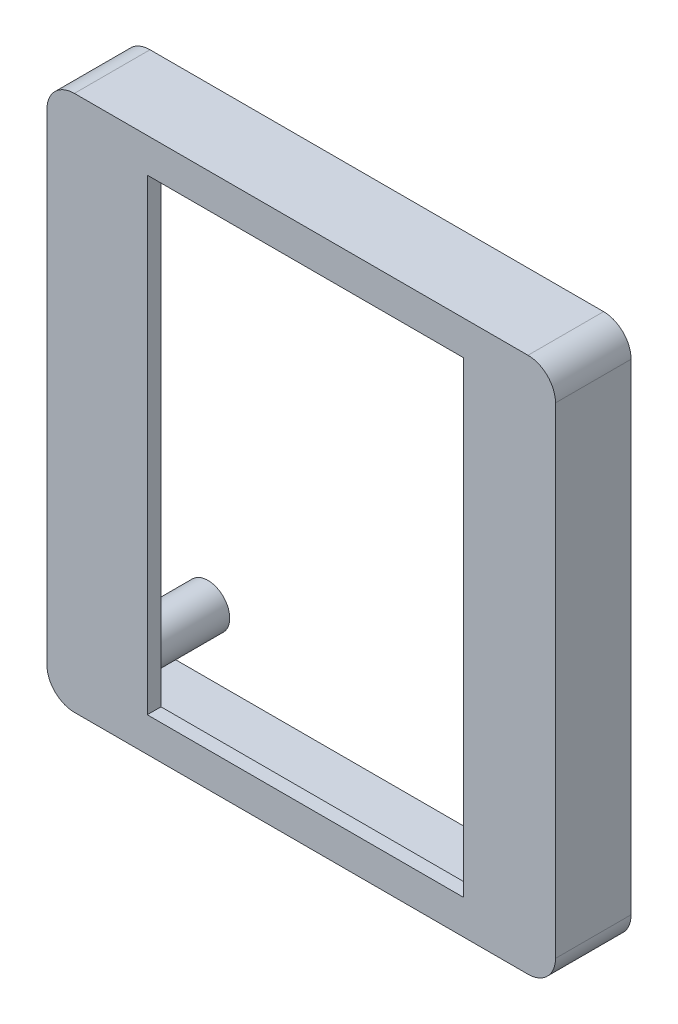
ISO-10303-21;
HEADER;
FILE_DESCRIPTION(('STEP AP214'),'2;1');
FILE_NAME('part.step','',(''),(''),'','','');
FILE_SCHEMA(('AUTOMOTIVE_DESIGN { 1 0 10303 214 1 1 1 1 }'));
ENDSEC;
DATA;
#1=APPLICATION_CONTEXT('core data for automotive mechanical design processes');
#2=APPLICATION_PROTOCOL_DEFINITION('international standard','automotive_design',2000,#1);
#3=PRODUCT_CONTEXT('',#1,'mechanical');
#4=PRODUCT('Part','Part','',(#3));
#5=PRODUCT_RELATED_PRODUCT_CATEGORY('part','',(#4));
#6=PRODUCT_DEFINITION_FORMATION('','',#4);
#7=PRODUCT_DEFINITION_CONTEXT('part definition',#1,'design');
#8=PRODUCT_DEFINITION('design','',#6,#7);
#9=PRODUCT_DEFINITION_SHAPE('','',#8);
#10=(LENGTH_UNIT() NAMED_UNIT(*) SI_UNIT(.MILLI.,.METRE.));
#11=(NAMED_UNIT(*) PLANE_ANGLE_UNIT() SI_UNIT($,.RADIAN.));
#12=(NAMED_UNIT(*) SI_UNIT($,.STERADIAN.) SOLID_ANGLE_UNIT());
#13=UNCERTAINTY_MEASURE_WITH_UNIT(LENGTH_MEASURE(1.E-05),#10,'distance_accuracy_value','');
#14=(GEOMETRIC_REPRESENTATION_CONTEXT(3) GLOBAL_UNCERTAINTY_ASSIGNED_CONTEXT((#13)) GLOBAL_UNIT_ASSIGNED_CONTEXT((#10,
#11,#12)) REPRESENTATION_CONTEXT('',''));
#15=CARTESIAN_POINT('',(0.,0.,0.));
#16=DIRECTION('',(0.,0.,1.));
#17=DIRECTION('',(1.,0.,0.));
#18=AXIS2_PLACEMENT_3D('',#15,#16,#17);
#19=CARTESIAN_POINT('',(0.,0.,6.5));
#20=DIRECTION('',(0.,0.,1.));
#21=DIRECTION('',(1.,0.,0.));
#22=AXIS2_PLACEMENT_3D('',#19,#20,#21);
#23=PLANE('',#22);
#24=DIRECTION('',(1.,0.,0.));
#25=VECTOR('',#24,1.);
#26=CARTESIAN_POINT('',(0.,2.84999999999995,6.5));
#27=LINE('',#26,#25);
#28=CARTESIAN_POINT('',(-10.6969645109202,2.84999999999995,6.5));
#29=VERTEX_POINT('',#28);
#30=CARTESIAN_POINT('',(12.3030354890798,2.84999999999995,6.5));
#31=VERTEX_POINT('',#30);
#32=EDGE_CURVE('E154',#29,#31,#27,.T.);
#33=ORIENTED_EDGE('',*,*,#32,.F.);
#34=DIRECTION('',(0.,-1.,0.));
#35=VECTOR('',#34,1.);
#36=CARTESIAN_POINT('',(-10.6969645109202,0.,6.5));
#37=LINE('',#36,#35);
#38=CARTESIAN_POINT('',(-10.6969645109202,-31.1500000000001,6.5));
#39=VERTEX_POINT('',#38);
#40=EDGE_CURVE('E163',#29,#39,#37,.T.);
#41=ORIENTED_EDGE('',*,*,#40,.T.);
#42=DIRECTION('',(1.,0.,0.));
#43=VECTOR('',#42,1.);
#44=CARTESIAN_POINT('',(0.,-31.1500000000001,6.5));
#45=LINE('',#44,#43);
#46=CARTESIAN_POINT('',(12.3030354890798,-31.1500000000001,6.5));
#47=VERTEX_POINT('',#46);
#48=EDGE_CURVE('E160',#39,#47,#45,.T.);
#49=ORIENTED_EDGE('',*,*,#48,.T.);
#50=DIRECTION('',(0.,-1.,0.));
#51=VECTOR('',#50,1.);
#52=CARTESIAN_POINT('',(12.3030354890798,0.,6.5));
#53=LINE('',#52,#51);
#54=EDGE_CURVE('E156',#31,#47,#53,.T.);
#55=ORIENTED_EDGE('',*,*,#54,.F.);
#56=EDGE_LOOP('',(#33,#41,#49,#55));
#57=FACE_BOUND('',#56,.T.);
#58=CARTESIAN_POINT('',(14.7905354890798,1.26249999999992,6.5));
#59=DIRECTION('',(0.,0.,1.));
#60=DIRECTION('',(1.,0.,0.));
#61=AXIS2_PLACEMENT_3D('',#58,#59,#60);
#62=CIRCLE('',#61,1.5875);
#63=CARTESIAN_POINT('',(16.3780354890798,1.26249999999992,6.5));
#64=VERTEX_POINT('',#63);
#65=EDGE_CURVE('E194',#64,#64,#62,.T.);
#66=ORIENTED_EDGE('',*,*,#65,.T.);
#67=EDGE_LOOP('',(#66));
#68=FACE_BOUND('',#67,.T.);
#69=CARTESIAN_POINT('',(14.7905354890798,-29.5625,6.5));
#70=DIRECTION('',(0.,0.,1.));
#71=DIRECTION('',(1.,0.,0.));
#72=AXIS2_PLACEMENT_3D('',#69,#70,#71);
#73=CIRCLE('',#72,1.58750000000005);
#74=CARTESIAN_POINT('',(16.3780354890799,-29.5625,6.5));
#75=VERTEX_POINT('',#74);
#76=EDGE_CURVE('E197',#75,#75,#73,.F.);
#77=ORIENTED_EDGE('',*,*,#76,.F.);
#78=EDGE_LOOP('',(#77));
#79=FACE_BOUND('',#78,.T.);
#80=CARTESIAN_POINT('',(-13.7844645109202,-29.5625,6.5));
#81=DIRECTION('',(0.,0.,1.));
#82=DIRECTION('',(1.,0.,0.));
#83=AXIS2_PLACEMENT_3D('',#80,#81,#82);
#84=CIRCLE('',#83,1.5875);
#85=CARTESIAN_POINT('',(-12.1969645109202,-29.5625,6.5));
#86=VERTEX_POINT('',#85);
#87=EDGE_CURVE('E48',#86,#86,#84,.F.);
#88=ORIENTED_EDGE('',*,*,#87,.F.);
#89=EDGE_LOOP('',(#88));
#90=FACE_BOUND('',#89,.T.);
#91=CARTESIAN_POINT('',(-13.7844645109202,1.26249999999993,6.5));
#92=DIRECTION('',(0.,0.,1.));
#93=DIRECTION('',(1.,0.,0.));
#94=AXIS2_PLACEMENT_3D('',#91,#92,#93);
#95=CIRCLE('',#94,1.5875);
#96=CARTESIAN_POINT('',(-12.1969645109202,1.26249999999993,6.5));
#97=VERTEX_POINT('',#96);
#98=EDGE_CURVE('E11',#97,#97,#95,.F.);
#99=ORIENTED_EDGE('',*,*,#98,.F.);
#100=EDGE_LOOP('',(#99));
#101=FACE_BOUND('',#100,.T.);
#102=DIRECTION('',(1.,0.,0.));
#103=VECTOR('',#102,1.);
#104=CARTESIAN_POINT('',(0.,3.84999999999995,6.5));
#105=LINE('',#104,#103);
#106=CARTESIAN_POINT('',(-16.4969645109202,3.84999999999995,6.5));
#107=VERTEX_POINT('',#106);
#108=CARTESIAN_POINT('',(17.5030354890798,3.84999999999995,6.5));
#109=VERTEX_POINT('',#108);
#110=EDGE_CURVE('E214',#107,#109,#105,.T.);
#111=ORIENTED_EDGE('',*,*,#110,.T.);
#112=DIRECTION('',(0.,-1.,0.));
#113=VECTOR('',#112,1.);
#114=CARTESIAN_POINT('',(17.5030354890798,0.,6.5));
#115=LINE('',#114,#113);
#116=CARTESIAN_POINT('',(17.5030354890798,-32.1500000000001,6.5));
#117=VERTEX_POINT('',#116);
#118=EDGE_CURVE('E218',#109,#117,#115,.T.);
#119=ORIENTED_EDGE('',*,*,#118,.T.);
#120=DIRECTION('',(1.,0.,0.));
#121=VECTOR('',#120,1.);
#122=CARTESIAN_POINT('',(0.,-32.1500000000001,6.5));
#123=LINE('',#122,#121);
#124=CARTESIAN_POINT('',(-16.4969645109202,-32.1500000000001,6.5));
#125=VERTEX_POINT('',#124);
#126=EDGE_CURVE('E235',#125,#117,#123,.T.);
#127=ORIENTED_EDGE('',*,*,#126,.F.);
#128=DIRECTION('',(0.,-1.,0.));
#129=VECTOR('',#128,1.);
#130=CARTESIAN_POINT('',(-16.4969645109202,0.,6.5));
#131=LINE('',#130,#129);
#132=CARTESIAN_POINT('',(-16.4969645109202,-19.4168859788941,6.5));
#133=VERTEX_POINT('',#132);
#134=EDGE_CURVE('E240',#133,#125,#131,.T.);
#135=ORIENTED_EDGE('',*,*,#134,.F.);
#136=CARTESIAN_POINT('',(-15.2469645109202,-18.4600000000001,6.5));
#137=DIRECTION('',(0.,0.,1.));
#138=DIRECTION('',(1.,0.,0.));
#139=AXIS2_PLACEMENT_3D('',#136,#137,#138);
#140=CIRCLE('',#139,1.57420798390938);
#141=CARTESIAN_POINT('',(-16.8211724948296,-18.4600000000001,6.5));
#142=VERTEX_POINT('',#141);
#143=EDGE_CURVE('E227',#133,#142,#140,.F.);
#144=ORIENTED_EDGE('',*,*,#143,.T.);
#145=DIRECTION('',(0.,1.,0.));
#146=VECTOR('',#145,1.);
#147=CARTESIAN_POINT('',(-16.8211724948297,-1.41341203553021E-13,6.5));
#148=LINE('',#147,#146);
#149=CARTESIAN_POINT('',(-16.8211724948296,-9.84000000000007,6.5));
#150=VERTEX_POINT('',#149);
#151=EDGE_CURVE('E246',#142,#150,#148,.T.);
#152=ORIENTED_EDGE('',*,*,#151,.T.);
#153=CARTESIAN_POINT('',(-15.2469645109202,-9.84000000000006,6.5));
#154=DIRECTION('',(0.,0.,1.));
#155=DIRECTION('',(1.,0.,0.));
#156=AXIS2_PLACEMENT_3D('',#153,#154,#155);
#157=CIRCLE('',#156,1.57420798390938);
#158=CARTESIAN_POINT('',(-16.4969645109202,-8.88311402110591,6.50000000000001));
#159=VERTEX_POINT('',#158);
#160=EDGE_CURVE('E249',#150,#159,#157,.F.);
#161=ORIENTED_EDGE('',*,*,#160,.T.);
#162=DIRECTION('',(0.,-1.,0.));
#163=VECTOR('',#162,1.);
#164=CARTESIAN_POINT('',(-16.4969645109202,0.,6.5));
#165=LINE('',#164,#163);
#166=EDGE_CURVE('E220',#107,#159,#165,.T.);
#167=ORIENTED_EDGE('',*,*,#166,.F.);
#168=EDGE_LOOP('',(#111,#119,#127,#135,#144,#152,#161,#167));
#169=FACE_BOUND('',#168,.T.);
#170=ADVANCED_FACE('F40',(#57,#68,#79,#90,#101,#169),#23,.F.);
#171=CARTESIAN_POINT('',(14.7905354890798,1.26249999999992,10.9901280605347));
#172=DIRECTION('',(0.,0.,-1.));
#173=DIRECTION('',(-1.,0.,0.));
#174=AXIS2_PLACEMENT_3D('',#171,#172,#173);
#175=CYLINDRICAL_SURFACE('',#174,1.5875);
#176=CARTESIAN_POINT('',(14.7905354890798,1.26249999999992,0.));
#177=DIRECTION('',(0.,0.,1.));
#178=DIRECTION('',(1.,0.,0.));
#179=AXIS2_PLACEMENT_3D('',#176,#177,#178);
#180=CIRCLE('',#179,1.5875);
#181=CARTESIAN_POINT('',(16.3780354890798,1.26249999999992,0.));
#182=VERTEX_POINT('',#181);
#183=EDGE_CURVE('E185',#182,#182,#180,.T.);
#184=ORIENTED_EDGE('',*,*,#183,.T.);
#185=EDGE_LOOP('',(#184));
#186=FACE_BOUND('',#185,.T.);
#187=ORIENTED_EDGE('',*,*,#65,.F.);
#188=EDGE_LOOP('',(#187));
#189=FACE_BOUND('',#188,.T.);
#190=ADVANCED_FACE('F42',(#186,#189),#175,.T.);
#191=CARTESIAN_POINT('',(14.7905354890798,1.26249999999992,0.));
#192=DIRECTION('',(0.,0.,1.));
#193=DIRECTION('',(1.,0.,0.));
#194=AXIS2_PLACEMENT_3D('',#191,#192,#193);
#195=PLANE('',#194);
#196=ORIENTED_EDGE('',*,*,#183,.F.);
#197=EDGE_LOOP('',(#196));
#198=FACE_BOUND('',#197,.T.);
#199=ADVANCED_FACE('F479',(#198),#195,.F.);
#200=CARTESIAN_POINT('',(17.0030354890798,3.34999999999995,7.5));
#201=DIRECTION('',(0.,0.,-1.));
#202=DIRECTION('',(-1.,0.,0.));
#203=AXIS2_PLACEMENT_3D('',#200,#201,#202);
#204=CYLINDRICAL_SURFACE('',#203,2.);
#205=DIRECTION('',(0.,0.,-1.));
#206=VECTOR('',#205,1.);
#207=CARTESIAN_POINT('',(19.0030354890798,3.34999999999995,7.5));
#208=LINE('',#207,#206);
#209=CARTESIAN_POINT('',(19.0030354890798,3.34999999999995,7.5));
#210=VERTEX_POINT('',#209);
#211=CARTESIAN_POINT('',(19.0030354890798,3.34999999999993,2.));
#212=VERTEX_POINT('',#211);
#213=EDGE_CURVE('E167',#210,#212,#208,.T.);
#214=ORIENTED_EDGE('',*,*,#213,.T.);
#215=CARTESIAN_POINT('',(17.0030354890798,3.34999999999995,2.));
#216=DIRECTION('',(0.,0.,1.));
#217=DIRECTION('',(1.,0.,0.));
#218=AXIS2_PLACEMENT_3D('',#215,#216,#217);
#219=CIRCLE('',#218,2.);
#220=CARTESIAN_POINT('',(17.0030354890798,5.34999999999995,2.));
#221=VERTEX_POINT('',#220);
#222=EDGE_CURVE('E275',#212,#221,#219,.T.);
#223=ORIENTED_EDGE('',*,*,#222,.T.);
#224=DIRECTION('',(0.,0.,-1.));
#225=VECTOR('',#224,1.);
#226=CARTESIAN_POINT('',(17.0030354890798,5.34999999999995,7.5));
#227=LINE('',#226,#225);
#228=CARTESIAN_POINT('',(17.0030354890798,5.34999999999995,7.5));
#229=VERTEX_POINT('',#228);
#230=EDGE_CURVE('E182',#229,#221,#227,.T.);
#231=ORIENTED_EDGE('',*,*,#230,.F.);
#232=CARTESIAN_POINT('',(17.0030354890798,3.34999999999995,7.5));
#233=DIRECTION('',(0.,0.,1.));
#234=DIRECTION('',(1.,0.,0.));
#235=AXIS2_PLACEMENT_3D('',#232,#233,#234);
#236=CIRCLE('',#235,2.);
#237=EDGE_CURVE('E293',#210,#229,#236,.T.);
#238=ORIENTED_EDGE('',*,*,#237,.F.);
#239=EDGE_LOOP('',(#214,#223,#231,#238));
#240=FACE_BOUND('',#239,.T.);
#241=ADVANCED_FACE('F475',(#240),#204,.T.);
#242=CARTESIAN_POINT('',(0.,5.34999999999995,7.5));
#243=DIRECTION('',(0.,-1.,0.));
#244=DIRECTION('',(0.,0.,-1.));
#245=AXIS2_PLACEMENT_3D('',#242,#243,#244);
#246=PLANE('',#245);
#247=ORIENTED_EDGE('',*,*,#230,.T.);
#248=DIRECTION('',(1.,0.,0.));
#249=VECTOR('',#248,1.);
#250=CARTESIAN_POINT('',(0.,5.34999999999995,2.));
#251=LINE('',#250,#249);
#252=CARTESIAN_POINT('',(-15.9969645109202,5.34999999999995,2.));
#253=VERTEX_POINT('',#252);
#254=EDGE_CURVE('E327',#253,#221,#251,.T.);
#255=ORIENTED_EDGE('',*,*,#254,.F.);
#256=DIRECTION('',(0.,0.,-1.));
#257=VECTOR('',#256,1.);
#258=CARTESIAN_POINT('',(-15.9969645109202,5.34999999999995,7.5));
#259=LINE('',#258,#257);
#260=CARTESIAN_POINT('',(-15.9969645109202,5.34999999999995,7.5));
#261=VERTEX_POINT('',#260);
#262=EDGE_CURVE('E179',#261,#253,#259,.T.);
#263=ORIENTED_EDGE('',*,*,#262,.F.);
#264=DIRECTION('',(-1.,0.,0.));
#265=VECTOR('',#264,1.);
#266=CARTESIAN_POINT('',(0.,5.34999999999995,7.5));
#267=LINE('',#266,#265);
#268=EDGE_CURVE('E295',#229,#261,#267,.T.);
#269=ORIENTED_EDGE('',*,*,#268,.F.);
#270=EDGE_LOOP('',(#247,#255,#263,#269));
#271=FACE_BOUND('',#270,.T.);
#272=ADVANCED_FACE('F471',(#271),#246,.F.);
#273=CARTESIAN_POINT('',(-15.9969645109202,3.34999999999995,7.5));
#274=DIRECTION('',(0.,0.,-1.));
#275=DIRECTION('',(-1.,0.,0.));
#276=AXIS2_PLACEMENT_3D('',#273,#274,#275);
#277=CYLINDRICAL_SURFACE('',#276,2.);
#278=ORIENTED_EDGE('',*,*,#262,.T.);
#279=CARTESIAN_POINT('',(-15.9969645109202,3.34999999999995,2.));
#280=DIRECTION('',(0.,0.,1.));
#281=DIRECTION('',(1.,0.,0.));
#282=AXIS2_PLACEMENT_3D('',#279,#280,#281);
#283=CIRCLE('',#282,2.);
#284=CARTESIAN_POINT('',(-17.9969645109202,3.34999999999993,2.));
#285=VERTEX_POINT('',#284);
#286=EDGE_CURVE('E321',#253,#285,#283,.T.);
#287=ORIENTED_EDGE('',*,*,#286,.T.);
#288=DIRECTION('',(0.,0.,-1.));
#289=VECTOR('',#288,1.);
#290=CARTESIAN_POINT('',(-17.9969645109202,3.34999999999993,7.5));
#291=LINE('',#290,#289);
#292=CARTESIAN_POINT('',(-17.9969645109202,3.34999999999993,7.5));
#293=VERTEX_POINT('',#292);
#294=EDGE_CURVE('E176',#293,#285,#291,.T.);
#295=ORIENTED_EDGE('',*,*,#294,.F.);
#296=CARTESIAN_POINT('',(-15.9969645109202,3.34999999999995,7.5));
#297=DIRECTION('',(0.,0.,1.));
#298=DIRECTION('',(1.,0.,0.));
#299=AXIS2_PLACEMENT_3D('',#296,#297,#298);
#300=CIRCLE('',#299,2.);
#301=EDGE_CURVE('E297',#261,#293,#300,.T.);
#302=ORIENTED_EDGE('',*,*,#301,.F.);
#303=EDGE_LOOP('',(#278,#287,#295,#302));
#304=FACE_BOUND('',#303,.T.);
#305=ADVANCED_FACE('F468',(#304),#277,.T.);
#306=CARTESIAN_POINT('',(-17.9969645109202,0.,7.5));
#307=DIRECTION('',(1.,0.,0.));
#308=DIRECTION('',(0.,0.,-1.));
#309=AXIS2_PLACEMENT_3D('',#306,#307,#308);
#310=PLANE('',#309);
#311=ORIENTED_EDGE('',*,*,#294,.T.);
#312=DIRECTION('',(0.,-1.,0.));
#313=VECTOR('',#312,1.);
#314=CARTESIAN_POINT('',(-17.9969645109202,0.,2.));
#315=LINE('',#314,#313);
#316=CARTESIAN_POINT('',(-17.9969645109202,-31.65,2.));
#317=VERTEX_POINT('',#316);
#318=EDGE_CURVE('E309',#285,#317,#315,.T.);
#319=ORIENTED_EDGE('',*,*,#318,.T.);
#320=DIRECTION('',(0.,0.,-1.));
#321=VECTOR('',#320,1.);
#322=CARTESIAN_POINT('',(-17.9969645109202,-31.65,7.5));
#323=LINE('',#322,#321);
#324=CARTESIAN_POINT('',(-17.9969645109202,-31.65,7.5));
#325=VERTEX_POINT('',#324);
#326=EDGE_CURVE('E173',#325,#317,#323,.T.);
#327=ORIENTED_EDGE('',*,*,#326,.F.);
#328=DIRECTION('',(0.,-1.,0.));
#329=VECTOR('',#328,1.);
#330=CARTESIAN_POINT('',(-17.9969645109202,0.,7.5));
#331=LINE('',#330,#329);
#332=EDGE_CURVE('E299',#293,#325,#331,.T.);
#333=ORIENTED_EDGE('',*,*,#332,.F.);
#334=EDGE_LOOP('',(#311,#319,#327,#333));
#335=FACE_BOUND('',#334,.T.);
#336=ADVANCED_FACE('F306',(#335),#310,.F.);
#337=CARTESIAN_POINT('',(-15.9969645109202,-31.6500000000001,7.5));
#338=DIRECTION('',(0.,0.,-1.));
#339=DIRECTION('',(-1.,0.,0.));
#340=AXIS2_PLACEMENT_3D('',#337,#338,#339);
#341=CYLINDRICAL_SURFACE('',#340,2.);
#342=ORIENTED_EDGE('',*,*,#326,.T.);
#343=CARTESIAN_POINT('',(-15.9969645109202,-31.6500000000001,2.));
#344=DIRECTION('',(0.,0.,1.));
#345=DIRECTION('',(1.,0.,0.));
#346=AXIS2_PLACEMENT_3D('',#343,#344,#345);
#347=CIRCLE('',#346,2.);
#348=CARTESIAN_POINT('',(-15.9969645109202,-33.6500000000001,2.));
#349=VERTEX_POINT('',#348);
#350=EDGE_CURVE('E225',#349,#317,#347,.F.);
#351=ORIENTED_EDGE('',*,*,#350,.F.);
#352=DIRECTION('',(0.,0.,-1.));
#353=VECTOR('',#352,1.);
#354=CARTESIAN_POINT('',(-15.9969645109202,-33.6500000000001,7.5));
#355=LINE('',#354,#353);
#356=CARTESIAN_POINT('',(-15.9969645109202,-33.6500000000001,7.5));
#357=VERTEX_POINT('',#356);
#358=EDGE_CURVE('E145',#357,#349,#355,.T.);
#359=ORIENTED_EDGE('',*,*,#358,.F.);
#360=CARTESIAN_POINT('',(-15.9969645109202,-31.6500000000001,7.5));
#361=DIRECTION('',(0.,0.,1.));
#362=DIRECTION('',(1.,0.,0.));
#363=AXIS2_PLACEMENT_3D('',#360,#361,#362);
#364=CIRCLE('',#363,2.);
#365=EDGE_CURVE('E130',#325,#357,#364,.T.);
#366=ORIENTED_EDGE('',*,*,#365,.F.);
#367=EDGE_LOOP('',(#342,#351,#359,#366));
#368=FACE_BOUND('',#367,.T.);
#369=ADVANCED_FACE('F312',(#368),#341,.T.);
#370=CARTESIAN_POINT('',(0.,-33.6500000000001,7.5));
#371=DIRECTION('',(0.,1.,0.));
#372=DIRECTION('',(0.,0.,1.));
#373=AXIS2_PLACEMENT_3D('',#370,#371,#372);
#374=PLANE('',#373);
#375=ORIENTED_EDGE('',*,*,#358,.T.);
#376=DIRECTION('',(1.,0.,0.));
#377=VECTOR('',#376,1.);
#378=CARTESIAN_POINT('',(0.,-33.6500000000001,2.));
#379=LINE('',#378,#377);
#380=CARTESIAN_POINT('',(17.0030354890798,-33.6500000000001,2.));
#381=VERTEX_POINT('',#380);
#382=EDGE_CURVE('E141',#349,#381,#379,.T.);
#383=ORIENTED_EDGE('',*,*,#382,.T.);
#384=DIRECTION('',(0.,0.,-1.));
#385=VECTOR('',#384,1.);
#386=CARTESIAN_POINT('',(17.0030354890798,-33.6500000000001,7.5));
#387=LINE('',#386,#385);
#388=CARTESIAN_POINT('',(17.0030354890798,-33.6500000000001,7.5));
#389=VERTEX_POINT('',#388);
#390=EDGE_CURVE('E137',#389,#381,#387,.T.);
#391=ORIENTED_EDGE('',*,*,#390,.F.);
#392=DIRECTION('',(1.,0.,0.));
#393=VECTOR('',#392,1.);
#394=CARTESIAN_POINT('',(0.,-33.6500000000001,7.5));
#395=LINE('',#394,#393);
#396=EDGE_CURVE('E123',#357,#389,#395,.T.);
#397=ORIENTED_EDGE('',*,*,#396,.F.);
#398=EDGE_LOOP('',(#375,#383,#391,#397));
#399=FACE_BOUND('',#398,.T.);
#400=ADVANCED_FACE('F138',(#399),#374,.F.);
#401=CARTESIAN_POINT('',(17.0030354890798,-31.6500000000001,7.5));
#402=DIRECTION('',(0.,0.,-1.));
#403=DIRECTION('',(-1.,0.,0.));
#404=AXIS2_PLACEMENT_3D('',#401,#402,#403);
#405=CYLINDRICAL_SURFACE('',#404,2.);
#406=ORIENTED_EDGE('',*,*,#390,.T.);
#407=CARTESIAN_POINT('',(17.0030354890798,-31.6500000000001,2.));
#408=DIRECTION('',(0.,0.,1.));
#409=DIRECTION('',(1.,0.,0.));
#410=AXIS2_PLACEMENT_3D('',#407,#408,#409);
#411=CIRCLE('',#410,2.);
#412=CARTESIAN_POINT('',(19.0030354890798,-31.65,2.));
#413=VERTEX_POINT('',#412);
#414=EDGE_CURVE('E277',#381,#413,#411,.T.);
#415=ORIENTED_EDGE('',*,*,#414,.T.);
#416=DIRECTION('',(0.,0.,-1.));
#417=VECTOR('',#416,1.);
#418=CARTESIAN_POINT('',(19.0030354890798,-31.65,7.5));
#419=LINE('',#418,#417);
#420=CARTESIAN_POINT('',(19.0030354890798,-31.65,7.5));
#421=VERTEX_POINT('',#420);
#422=EDGE_CURVE('E146',#421,#413,#419,.T.);
#423=ORIENTED_EDGE('',*,*,#422,.F.);
#424=CARTESIAN_POINT('',(17.0030354890798,-31.6500000000001,7.5));
#425=DIRECTION('',(0.,0.,1.));
#426=DIRECTION('',(1.,0.,0.));
#427=AXIS2_PLACEMENT_3D('',#424,#425,#426);
#428=CIRCLE('',#427,2.);
#429=EDGE_CURVE('E127',#389,#421,#428,.T.);
#430=ORIENTED_EDGE('',*,*,#429,.F.);
#431=EDGE_LOOP('',(#406,#415,#423,#430));
#432=FACE_BOUND('',#431,.T.);
#433=ADVANCED_FACE('F148',(#432),#405,.T.);
#434=CARTESIAN_POINT('',(0.,2.84999999999995,7.5));
#435=DIRECTION('',(0.,1.,0.));
#436=DIRECTION('',(0.,0.,1.));
#437=AXIS2_PLACEMENT_3D('',#434,#435,#436);
#438=PLANE('',#437);
#439=ORIENTED_EDGE('',*,*,#32,.T.);
#440=DIRECTION('',(0.,0.,-1.));
#441=VECTOR('',#440,1.);
#442=CARTESIAN_POINT('',(12.3030354890798,2.84999999999995,7.5));
#443=LINE('',#442,#441);
#444=CARTESIAN_POINT('',(12.3030354890798,2.84999999999995,7.5));
#445=VERTEX_POINT('',#444);
#446=EDGE_CURVE('E170',#445,#31,#443,.T.);
#447=ORIENTED_EDGE('',*,*,#446,.F.);
#448=DIRECTION('',(1.,0.,0.));
#449=VECTOR('',#448,1.);
#450=CARTESIAN_POINT('',(0.,2.84999999999995,7.5));
#451=LINE('',#450,#449);
#452=CARTESIAN_POINT('',(-10.6969645109202,2.84999999999995,7.5));
#453=VERTEX_POINT('',#452);
#454=EDGE_CURVE('E166',#453,#445,#451,.T.);
#455=ORIENTED_EDGE('',*,*,#454,.F.);
#456=DIRECTION('',(0.,0.,-1.));
#457=VECTOR('',#456,1.);
#458=CARTESIAN_POINT('',(-10.6969645109202,2.84999999999995,7.5));
#459=LINE('',#458,#457);
#460=EDGE_CURVE('E86',#453,#29,#459,.T.);
#461=ORIENTED_EDGE('',*,*,#460,.T.);
#462=EDGE_LOOP('',(#439,#447,#455,#461));
#463=FACE_BOUND('',#462,.T.);
#464=ADVANCED_FACE('F461',(#463),#438,.F.);
#465=CARTESIAN_POINT('',(12.3030354890798,0.,7.5));
#466=DIRECTION('',(1.,0.,0.));
#467=DIRECTION('',(0.,0.,-1.));
#468=AXIS2_PLACEMENT_3D('',#465,#466,#467);
#469=PLANE('',#468);
#470=ORIENTED_EDGE('',*,*,#54,.T.);
#471=DIRECTION('',(0.,0.,-1.));
#472=VECTOR('',#471,1.);
#473=CARTESIAN_POINT('',(12.3030354890798,-31.1500000000001,7.5));
#474=LINE('',#473,#472);
#475=CARTESIAN_POINT('',(12.3030354890798,-31.1500000000001,7.5));
#476=VERTEX_POINT('',#475);
#477=EDGE_CURVE('E189',#476,#47,#474,.T.);
#478=ORIENTED_EDGE('',*,*,#477,.F.);
#479=DIRECTION('',(0.,-1.,0.));
#480=VECTOR('',#479,1.);
#481=CARTESIAN_POINT('',(12.3030354890798,0.,7.5));
#482=LINE('',#481,#480);
#483=EDGE_CURVE('E95',#445,#476,#482,.T.);
#484=ORIENTED_EDGE('',*,*,#483,.F.);
#485=ORIENTED_EDGE('',*,*,#446,.T.);
#486=EDGE_LOOP('',(#470,#478,#484,#485));
#487=FACE_BOUND('',#486,.T.);
#488=ADVANCED_FACE('F486',(#487),#469,.F.);
#489=CARTESIAN_POINT('',(0.,-31.1500000000001,7.5));
#490=DIRECTION('',(0.,1.,0.));
#491=DIRECTION('',(0.,0.,1.));
#492=AXIS2_PLACEMENT_3D('',#489,#490,#491);
#493=PLANE('',#492);
#494=ORIENTED_EDGE('',*,*,#48,.F.);
#495=DIRECTION('',(0.,0.,-1.));
#496=VECTOR('',#495,1.);
#497=CARTESIAN_POINT('',(-10.6969645109202,-31.1500000000001,7.5));
#498=LINE('',#497,#496);
#499=CARTESIAN_POINT('',(-10.6969645109202,-31.1500000000001,7.5));
#500=VERTEX_POINT('',#499);
#501=EDGE_CURVE('E187',#500,#39,#498,.T.);
#502=ORIENTED_EDGE('',*,*,#501,.F.);
#503=DIRECTION('',(1.,0.,0.));
#504=VECTOR('',#503,1.);
#505=CARTESIAN_POINT('',(0.,-31.1500000000001,7.5));
#506=LINE('',#505,#504);
#507=EDGE_CURVE('E287',#500,#476,#506,.T.);
#508=ORIENTED_EDGE('',*,*,#507,.T.);
#509=ORIENTED_EDGE('',*,*,#477,.T.);
#510=EDGE_LOOP('',(#494,#502,#508,#509));
#511=FACE_BOUND('',#510,.T.);
#512=ADVANCED_FACE('F482',(#511),#493,.T.);
#513=CARTESIAN_POINT('',(-10.6969645109202,0.,7.5));
#514=DIRECTION('',(1.,0.,0.));
#515=DIRECTION('',(0.,0.,-1.));
#516=AXIS2_PLACEMENT_3D('',#513,#514,#515);
#517=PLANE('',#516);
#518=ORIENTED_EDGE('',*,*,#40,.F.);
#519=ORIENTED_EDGE('',*,*,#460,.F.);
#520=DIRECTION('',(0.,-1.,0.));
#521=VECTOR('',#520,1.);
#522=CARTESIAN_POINT('',(-10.6969645109202,0.,7.5));
#523=LINE('',#522,#521);
#524=EDGE_CURVE('E290',#453,#500,#523,.T.);
#525=ORIENTED_EDGE('',*,*,#524,.T.);
#526=ORIENTED_EDGE('',*,*,#501,.T.);
#527=EDGE_LOOP('',(#518,#519,#525,#526));
#528=FACE_BOUND('',#527,.T.);
#529=ADVANCED_FACE('F458',(#528),#517,.T.);
#530=CARTESIAN_POINT('',(19.0030354890798,0.,7.5));
#531=DIRECTION('',(-1.,0.,0.));
#532=DIRECTION('',(0.,0.,1.));
#533=AXIS2_PLACEMENT_3D('',#530,#531,#532);
#534=PLANE('',#533);
#535=ORIENTED_EDGE('',*,*,#422,.T.);
#536=DIRECTION('',(0.,-1.,0.));
#537=VECTOR('',#536,1.);
#538=CARTESIAN_POINT('',(19.0030354890798,0.,2.));
#539=LINE('',#538,#537);
#540=EDGE_CURVE('E230',#212,#413,#539,.T.);
#541=ORIENTED_EDGE('',*,*,#540,.F.);
#542=ORIENTED_EDGE('',*,*,#213,.F.);
#543=DIRECTION('',(0.,1.,0.));
#544=VECTOR('',#543,1.);
#545=CARTESIAN_POINT('',(19.0030354890798,0.,7.5));
#546=LINE('',#545,#544);
#547=EDGE_CURVE('E64',#421,#210,#546,.T.);
#548=ORIENTED_EDGE('',*,*,#547,.F.);
#549=EDGE_LOOP('',(#535,#541,#542,#548));
#550=FACE_BOUND('',#549,.T.);
#551=ADVANCED_FACE('F368',(#550),#534,.F.);
#552=CARTESIAN_POINT('',(0.,0.,7.5));
#553=DIRECTION('',(0.,0.,1.));
#554=DIRECTION('',(1.,0.,0.));
#555=AXIS2_PLACEMENT_3D('',#552,#553,#554);
#556=PLANE('',#555);
#557=ORIENTED_EDGE('',*,*,#454,.T.);
#558=ORIENTED_EDGE('',*,*,#483,.T.);
#559=ORIENTED_EDGE('',*,*,#507,.F.);
#560=ORIENTED_EDGE('',*,*,#524,.F.);
#561=EDGE_LOOP('',(#557,#558,#559,#560));
#562=FACE_BOUND('',#561,.T.);
#563=ORIENTED_EDGE('',*,*,#237,.T.);
#564=ORIENTED_EDGE('',*,*,#268,.T.);
#565=ORIENTED_EDGE('',*,*,#301,.T.);
#566=ORIENTED_EDGE('',*,*,#332,.T.);
#567=ORIENTED_EDGE('',*,*,#365,.T.);
#568=ORIENTED_EDGE('',*,*,#396,.T.);
#569=ORIENTED_EDGE('',*,*,#429,.T.);
#570=ORIENTED_EDGE('',*,*,#547,.T.);
#571=EDGE_LOOP('',(#563,#564,#565,#566,#567,#568,#569,#570));
#572=FACE_BOUND('',#571,.T.);
#573=ADVANCED_FACE('F125',(#562,#572),#556,.T.);
#574=CARTESIAN_POINT('',(14.7905354890798,-29.5625,10.9901280605347));
#575=DIRECTION('',(0.,0.,-1.));
#576=DIRECTION('',(-1.,0.,0.));
#577=AXIS2_PLACEMENT_3D('',#574,#575,#576);
#578=CYLINDRICAL_SURFACE('',#577,1.58750000000005);
#579=CARTESIAN_POINT('',(14.7905354890798,-29.5625,0.));
#580=DIRECTION('',(0.,0.,1.));
#581=DIRECTION('',(1.,0.,0.));
#582=AXIS2_PLACEMENT_3D('',#579,#580,#581);
#583=CIRCLE('',#582,1.58750000000005);
#584=CARTESIAN_POINT('',(16.3780354890799,-29.5625,0.));
#585=VERTEX_POINT('',#584);
#586=EDGE_CURVE('E157',#585,#585,#583,.T.);
#587=ORIENTED_EDGE('',*,*,#586,.T.);
#588=EDGE_LOOP('',(#587));
#589=FACE_BOUND('',#588,.T.);
#590=ORIENTED_EDGE('',*,*,#76,.T.);
#591=EDGE_LOOP('',(#590));
#592=FACE_BOUND('',#591,.T.);
#593=ADVANCED_FACE('F446',(#589,#592),#578,.T.);
#594=CARTESIAN_POINT('',(14.7905354890798,-29.5625,0.));
#595=DIRECTION('',(0.,0.,1.));
#596=DIRECTION('',(1.,0.,0.));
#597=AXIS2_PLACEMENT_3D('',#594,#595,#596);
#598=PLANE('',#597);
#599=ORIENTED_EDGE('',*,*,#586,.F.);
#600=EDGE_LOOP('',(#599));
#601=FACE_BOUND('',#600,.T.);
#602=ADVANCED_FACE('F441',(#601),#598,.F.);
#603=CARTESIAN_POINT('',(-13.7844645109202,-29.5625,10.9901280605347));
#604=DIRECTION('',(0.,0.,-1.));
#605=DIRECTION('',(-1.,0.,0.));
#606=AXIS2_PLACEMENT_3D('',#603,#604,#605);
#607=CYLINDRICAL_SURFACE('',#606,1.5875);
#608=CARTESIAN_POINT('',(-13.7844645109202,-29.5625,0.));
#609=DIRECTION('',(0.,0.,1.));
#610=DIRECTION('',(1.,0.,0.));
#611=AXIS2_PLACEMENT_3D('',#608,#609,#610);
#612=CIRCLE('',#611,1.5875);
#613=CARTESIAN_POINT('',(-12.1969645109202,-29.5625,0.));
#614=VERTEX_POINT('',#613);
#615=EDGE_CURVE('E280',#614,#614,#612,.T.);
#616=ORIENTED_EDGE('',*,*,#615,.T.);
#617=EDGE_LOOP('',(#616));
#618=FACE_BOUND('',#617,.T.);
#619=ORIENTED_EDGE('',*,*,#87,.T.);
#620=EDGE_LOOP('',(#619));
#621=FACE_BOUND('',#620,.T.);
#622=ADVANCED_FACE('F202',(#618,#621),#607,.T.);
#623=CARTESIAN_POINT('',(-13.7844645109202,-29.5625,0.));
#624=DIRECTION('',(0.,0.,1.));
#625=DIRECTION('',(1.,0.,0.));
#626=AXIS2_PLACEMENT_3D('',#623,#624,#625);
#627=PLANE('',#626);
#628=ORIENTED_EDGE('',*,*,#615,.F.);
#629=EDGE_LOOP('',(#628));
#630=FACE_BOUND('',#629,.T.);
#631=ADVANCED_FACE('F434',(#630),#627,.F.);
#632=CARTESIAN_POINT('',(-13.7844645109202,1.26249999999993,10.9901280605347));
#633=DIRECTION('',(0.,0.,-1.));
#634=DIRECTION('',(-1.,0.,0.));
#635=AXIS2_PLACEMENT_3D('',#632,#633,#634);
#636=CYLINDRICAL_SURFACE('',#635,1.5875);
#637=CARTESIAN_POINT('',(-13.7844645109202,1.26249999999993,0.));
#638=DIRECTION('',(0.,0.,1.));
#639=DIRECTION('',(1.,0.,0.));
#640=AXIS2_PLACEMENT_3D('',#637,#638,#639);
#641=CIRCLE('',#640,1.5875);
#642=CARTESIAN_POINT('',(-12.1969645109202,1.26249999999993,0.));
#643=VERTEX_POINT('',#642);
#644=EDGE_CURVE('E251',#643,#643,#641,.T.);
#645=ORIENTED_EDGE('',*,*,#644,.T.);
#646=EDGE_LOOP('',(#645));
#647=FACE_BOUND('',#646,.T.);
#648=ORIENTED_EDGE('',*,*,#98,.T.);
#649=EDGE_LOOP('',(#648));
#650=FACE_BOUND('',#649,.T.);
#651=ADVANCED_FACE('F431',(#647,#650),#636,.T.);
#652=CARTESIAN_POINT('',(-13.7844645109202,1.26249999999993,0.));
#653=DIRECTION('',(0.,0.,1.));
#654=DIRECTION('',(1.,0.,0.));
#655=AXIS2_PLACEMENT_3D('',#652,#653,#654);
#656=PLANE('',#655);
#657=ORIENTED_EDGE('',*,*,#644,.F.);
#658=EDGE_LOOP('',(#657));
#659=FACE_BOUND('',#658,.T.);
#660=ADVANCED_FACE('F427',(#659),#656,.F.);
#661=CARTESIAN_POINT('',(0.,3.84999999999995,60.2587202228625));
#662=DIRECTION('',(0.,1.,0.));
#663=DIRECTION('',(0.,0.,1.));
#664=AXIS2_PLACEMENT_3D('',#661,#662,#663);
#665=PLANE('',#664);
#666=ORIENTED_EDGE('',*,*,#110,.F.);
#667=DIRECTION('',(0.,0.,-1.));
#668=VECTOR('',#667,1.);
#669=CARTESIAN_POINT('',(-16.4969645109202,3.84999999999995,60.2587202228625));
#670=LINE('',#669,#668);
#671=CARTESIAN_POINT('',(-16.4969645109202,3.84999999999995,2.));
#672=VERTEX_POINT('',#671);
#673=EDGE_CURVE('E55',#107,#672,#670,.T.);
#674=ORIENTED_EDGE('',*,*,#673,.T.);
#675=DIRECTION('',(1.,0.,0.));
#676=VECTOR('',#675,1.);
#677=CARTESIAN_POINT('',(0.,3.84999999999995,2.));
#678=LINE('',#677,#676);
#679=CARTESIAN_POINT('',(17.5030354890798,3.84999999999995,2.));
#680=VERTEX_POINT('',#679);
#681=EDGE_CURVE('E255',#672,#680,#678,.T.);
#682=ORIENTED_EDGE('',*,*,#681,.T.);
#683=DIRECTION('',(0.,0.,-1.));
#684=VECTOR('',#683,1.);
#685=CARTESIAN_POINT('',(17.5030354890798,3.84999999999995,60.2587202228625));
#686=LINE('',#685,#684);
#687=EDGE_CURVE('E252',#109,#680,#686,.T.);
#688=ORIENTED_EDGE('',*,*,#687,.F.);
#689=EDGE_LOOP('',(#666,#674,#682,#688));
#690=FACE_BOUND('',#689,.T.);
#691=ADVANCED_FACE('F346',(#690),#665,.F.);
#692=CARTESIAN_POINT('',(17.5030354890798,0.,60.2587202228625));
#693=DIRECTION('',(1.,0.,0.));
#694=DIRECTION('',(0.,0.,-1.));
#695=AXIS2_PLACEMENT_3D('',#692,#693,#694);
#696=PLANE('',#695);
#697=ORIENTED_EDGE('',*,*,#118,.F.);
#698=ORIENTED_EDGE('',*,*,#687,.T.);
#699=DIRECTION('',(0.,-1.,0.));
#700=VECTOR('',#699,1.);
#701=CARTESIAN_POINT('',(17.5030354890798,0.,2.));
#702=LINE('',#701,#700);
#703=CARTESIAN_POINT('',(17.5030354890798,-32.1500000000001,2.));
#704=VERTEX_POINT('',#703);
#705=EDGE_CURVE('E239',#680,#704,#702,.T.);
#706=ORIENTED_EDGE('',*,*,#705,.T.);
#707=DIRECTION('',(0.,0.,-1.));
#708=VECTOR('',#707,1.);
#709=CARTESIAN_POINT('',(17.5030354890798,-32.1500000000001,60.2587202228625));
#710=LINE('',#709,#708);
#711=EDGE_CURVE('E238',#117,#704,#710,.T.);
#712=ORIENTED_EDGE('',*,*,#711,.F.);
#713=EDGE_LOOP('',(#697,#698,#706,#712));
#714=FACE_BOUND('',#713,.T.);
#715=ADVANCED_FACE('F419',(#714),#696,.F.);
#716=CARTESIAN_POINT('',(0.,-32.1500000000001,60.2587202228625));
#717=DIRECTION('',(0.,1.,0.));
#718=DIRECTION('',(0.,0.,1.));
#719=AXIS2_PLACEMENT_3D('',#716,#717,#718);
#720=PLANE('',#719);
#721=DIRECTION('',(0.,0.,-1.));
#722=VECTOR('',#721,1.);
#723=CARTESIAN_POINT('',(-16.4969645109202,-32.1500000000001,60.2587202228625));
#724=LINE('',#723,#722);
#725=CARTESIAN_POINT('',(-16.4969645109202,-32.1500000000001,2.));
#726=VERTEX_POINT('',#725);
#727=EDGE_CURVE('E243',#125,#726,#724,.T.);
#728=ORIENTED_EDGE('',*,*,#727,.F.);
#729=ORIENTED_EDGE('',*,*,#126,.T.);
#730=ORIENTED_EDGE('',*,*,#711,.T.);
#731=DIRECTION('',(1.,0.,0.));
#732=VECTOR('',#731,1.);
#733=CARTESIAN_POINT('',(0.,-32.1500000000001,2.));
#734=LINE('',#733,#732);
#735=EDGE_CURVE('E329',#726,#704,#734,.T.);
#736=ORIENTED_EDGE('',*,*,#735,.F.);
#737=EDGE_LOOP('',(#728,#729,#730,#736));
#738=FACE_BOUND('',#737,.T.);
#739=ADVANCED_FACE('F417',(#738),#720,.T.);
#740=CARTESIAN_POINT('',(-16.4969645109202,0.,60.2587202228625));
#741=DIRECTION('',(1.,0.,0.));
#742=DIRECTION('',(0.,0.,-1.));
#743=AXIS2_PLACEMENT_3D('',#740,#741,#742);
#744=PLANE('',#743);
#745=DIRECTION('',(0.,0.,-1.));
#746=VECTOR('',#745,1.);
#747=CARTESIAN_POINT('',(-16.4969645109202,-19.4168859788941,60.2587202228625));
#748=LINE('',#747,#746);
#749=CARTESIAN_POINT('',(-16.4969645109202,-19.4168859788941,2.));
#750=VERTEX_POINT('',#749);
#751=EDGE_CURVE('E260',#133,#750,#748,.T.);
#752=ORIENTED_EDGE('',*,*,#751,.F.);
#753=ORIENTED_EDGE('',*,*,#134,.T.);
#754=ORIENTED_EDGE('',*,*,#727,.T.);
#755=DIRECTION('',(0.,-1.,0.));
#756=VECTOR('',#755,1.);
#757=CARTESIAN_POINT('',(-16.4969645109202,0.,2.));
#758=LINE('',#757,#756);
#759=EDGE_CURVE('E336',#750,#726,#758,.T.);
#760=ORIENTED_EDGE('',*,*,#759,.F.);
#761=EDGE_LOOP('',(#752,#753,#754,#760));
#762=FACE_BOUND('',#761,.T.);
#763=ADVANCED_FACE('F414',(#762),#744,.T.);
#764=CARTESIAN_POINT('',(-15.2469645109202,-18.4600000000001,60.2587202228625));
#765=DIRECTION('',(0.,0.,-1.));
#766=DIRECTION('',(-1.,0.,0.));
#767=AXIS2_PLACEMENT_3D('',#764,#765,#766);
#768=CYLINDRICAL_SURFACE('',#767,1.57420798390938);
#769=ORIENTED_EDGE('',*,*,#143,.F.);
#770=ORIENTED_EDGE('',*,*,#751,.T.);
#771=CARTESIAN_POINT('',(-15.2469645109202,-18.4600000000001,2.));
#772=DIRECTION('',(0.,0.,1.));
#773=DIRECTION('',(1.,0.,0.));
#774=AXIS2_PLACEMENT_3D('',#771,#772,#773);
#775=CIRCLE('',#774,1.57420798390938);
#776=CARTESIAN_POINT('',(-16.8211724948296,-18.4600000000001,2.));
#777=VERTEX_POINT('',#776);
#778=EDGE_CURVE('E263',#750,#777,#775,.F.);
#779=ORIENTED_EDGE('',*,*,#778,.T.);
#780=DIRECTION('',(0.,0.,-1.));
#781=VECTOR('',#780,1.);
#782=CARTESIAN_POINT('',(-16.8211724948296,-18.4600000000001,60.2587202228625));
#783=LINE('',#782,#781);
#784=EDGE_CURVE('E264',#142,#777,#783,.T.);
#785=ORIENTED_EDGE('',*,*,#784,.F.);
#786=EDGE_LOOP('',(#769,#770,#779,#785));
#787=FACE_BOUND('',#786,.T.);
#788=ADVANCED_FACE('F411',(#787),#768,.F.);
#789=CARTESIAN_POINT('',(-16.8211724948297,-1.42176737639203E-13,60.2587202228625));
#790=DIRECTION('',(-1.,0.,0.));
#791=DIRECTION('',(0.,-1.,0.));
#792=AXIS2_PLACEMENT_3D('',#789,#790,#791);
#793=PLANE('',#792);
#794=ORIENTED_EDGE('',*,*,#151,.F.);
#795=ORIENTED_EDGE('',*,*,#784,.T.);
#796=DIRECTION('',(0.,1.,0.));
#797=VECTOR('',#796,1.);
#798=CARTESIAN_POINT('',(-16.8211724948297,-1.42176737639203E-13,2.));
#799=LINE('',#798,#797);
#800=CARTESIAN_POINT('',(-16.8211724948296,-9.84000000000007,2.));
#801=VERTEX_POINT('',#800);
#802=EDGE_CURVE('E267',#777,#801,#799,.T.);
#803=ORIENTED_EDGE('',*,*,#802,.T.);
#804=DIRECTION('',(0.,0.,-1.));
#805=VECTOR('',#804,1.);
#806=CARTESIAN_POINT('',(-16.8211724948296,-9.84000000000007,60.2587202228625));
#807=LINE('',#806,#805);
#808=EDGE_CURVE('E268',#150,#801,#807,.T.);
#809=ORIENTED_EDGE('',*,*,#808,.F.);
#810=EDGE_LOOP('',(#794,#795,#803,#809));
#811=FACE_BOUND('',#810,.T.);
#812=ADVANCED_FACE('F408',(#811),#793,.F.);
#813=CARTESIAN_POINT('',(-15.2469645109202,-9.84000000000006,60.2587202228625));
#814=DIRECTION('',(0.,0.,-1.));
#815=DIRECTION('',(-1.,0.,0.));
#816=AXIS2_PLACEMENT_3D('',#813,#814,#815);
#817=CYLINDRICAL_SURFACE('',#816,1.57420798390938);
#818=ORIENTED_EDGE('',*,*,#160,.F.);
#819=ORIENTED_EDGE('',*,*,#808,.T.);
#820=CARTESIAN_POINT('',(-15.2469645109202,-9.84000000000006,2.));
#821=DIRECTION('',(0.,0.,1.));
#822=DIRECTION('',(1.,0.,0.));
#823=AXIS2_PLACEMENT_3D('',#820,#821,#822);
#824=CIRCLE('',#823,1.57420798390938);
#825=CARTESIAN_POINT('',(-16.4969645109202,-8.88311402110591,2.));
#826=VERTEX_POINT('',#825);
#827=EDGE_CURVE('E271',#801,#826,#824,.F.);
#828=ORIENTED_EDGE('',*,*,#827,.T.);
#829=DIRECTION('',(0.,0.,-1.));
#830=VECTOR('',#829,1.);
#831=CARTESIAN_POINT('',(-16.4969645109202,-8.88311402110591,60.2587202228625));
#832=LINE('',#831,#830);
#833=EDGE_CURVE('E272',#159,#826,#832,.T.);
#834=ORIENTED_EDGE('',*,*,#833,.F.);
#835=EDGE_LOOP('',(#818,#819,#828,#834));
#836=FACE_BOUND('',#835,.T.);
#837=ADVANCED_FACE('F406',(#836),#817,.F.);
#838=ORIENTED_EDGE('',*,*,#673,.F.);
#839=ORIENTED_EDGE('',*,*,#166,.T.);
#840=ORIENTED_EDGE('',*,*,#833,.T.);
#841=EDGE_CURVE('E339',#672,#826,#758,.T.);
#842=ORIENTED_EDGE('',*,*,#841,.F.);
#843=EDGE_LOOP('',(#838,#839,#840,#842));
#844=FACE_BOUND('',#843,.T.);
#845=ADVANCED_FACE('F357',(#844),#744,.T.);
#846=CARTESIAN_POINT('',(0.,0.,2.));
#847=DIRECTION('',(0.,0.,1.));
#848=DIRECTION('',(1.,0.,0.));
#849=AXIS2_PLACEMENT_3D('',#846,#847,#848);
#850=PLANE('',#849);
#851=ORIENTED_EDGE('',*,*,#681,.F.);
#852=ORIENTED_EDGE('',*,*,#841,.T.);
#853=ORIENTED_EDGE('',*,*,#827,.F.);
#854=ORIENTED_EDGE('',*,*,#802,.F.);
#855=ORIENTED_EDGE('',*,*,#778,.F.);
#856=ORIENTED_EDGE('',*,*,#759,.T.);
#857=ORIENTED_EDGE('',*,*,#735,.T.);
#858=ORIENTED_EDGE('',*,*,#705,.F.);
#859=EDGE_LOOP('',(#851,#852,#853,#854,#855,#856,#857,#858));
#860=FACE_BOUND('',#859,.T.);
#861=ORIENTED_EDGE('',*,*,#254,.T.);
#862=ORIENTED_EDGE('',*,*,#222,.F.);
#863=ORIENTED_EDGE('',*,*,#540,.T.);
#864=ORIENTED_EDGE('',*,*,#414,.F.);
#865=ORIENTED_EDGE('',*,*,#382,.F.);
#866=ORIENTED_EDGE('',*,*,#350,.T.);
#867=ORIENTED_EDGE('',*,*,#318,.F.);
#868=ORIENTED_EDGE('',*,*,#286,.F.);
#869=EDGE_LOOP('',(#861,#862,#863,#864,#865,#866,#867,#868));
#870=FACE_BOUND('',#869,.T.);
#871=ADVANCED_FACE('F317',(#860,#870),#850,.F.);
#872=CLOSED_SHELL('',(#170,#190,#199,#241,#272,#305,#336,#369,#400,#433,#464,#488,#512,#529,
#551,#573,#593,#602,#622,#631,#651,#660,#691,#715,#739,#763,#788,#812,#837,#845,#871));
#873=MANIFOLD_SOLID_BREP('B2',#872);
#874=ADVANCED_BREP_SHAPE_REPRESENTATION('',(#18,#873),#14);
#875=SHAPE_DEFINITION_REPRESENTATION(#9,#874);
ENDSEC;
END-ISO-10303-21;
